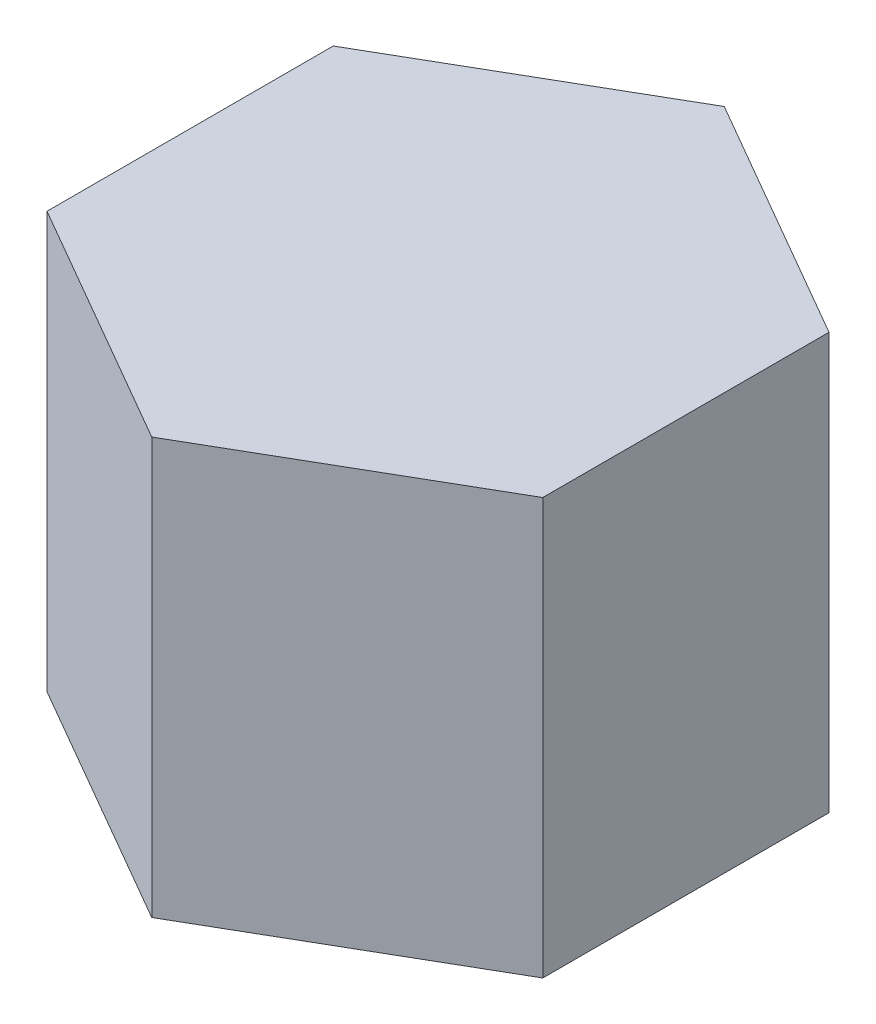
ISO-10303-21;
HEADER;
FILE_DESCRIPTION(('STEP AP214'),'2;1');
FILE_NAME('part.step','',(''),(''),'','','');
FILE_SCHEMA(('AUTOMOTIVE_DESIGN { 1 0 10303 214 1 1 1 1 }'));
ENDSEC;
DATA;
#1=APPLICATION_CONTEXT('core data for automotive mechanical design processes');
#2=APPLICATION_PROTOCOL_DEFINITION('international standard','automotive_design',2000,#1);
#3=PRODUCT_CONTEXT('',#1,'mechanical');
#4=PRODUCT('Part','Part','',(#3));
#5=PRODUCT_RELATED_PRODUCT_CATEGORY('part','',(#4));
#6=PRODUCT_DEFINITION_FORMATION('','',#4);
#7=PRODUCT_DEFINITION_CONTEXT('part definition',#1,'design');
#8=PRODUCT_DEFINITION('design','',#6,#7);
#9=PRODUCT_DEFINITION_SHAPE('','',#8);
#10=(LENGTH_UNIT() NAMED_UNIT(*) SI_UNIT(.MILLI.,.METRE.));
#11=(NAMED_UNIT(*) PLANE_ANGLE_UNIT() SI_UNIT($,.RADIAN.));
#12=(NAMED_UNIT(*) SI_UNIT($,.STERADIAN.) SOLID_ANGLE_UNIT());
#13=UNCERTAINTY_MEASURE_WITH_UNIT(LENGTH_MEASURE(1.E-05),#10,'distance_accuracy_value','');
#14=(GEOMETRIC_REPRESENTATION_CONTEXT(3) GLOBAL_UNCERTAINTY_ASSIGNED_CONTEXT((#13)) GLOBAL_UNIT_ASSIGNED_CONTEXT((#10,
#11,#12)) REPRESENTATION_CONTEXT('',''));
#15=CARTESIAN_POINT('',(0.,0.,0.));
#16=DIRECTION('',(0.,0.,1.));
#17=DIRECTION('',(1.,0.,0.));
#18=AXIS2_PLACEMENT_3D('',#15,#16,#17);
#19=CARTESIAN_POINT('',(209.839551417381,-147.556598747966,294.280047431848));
#20=DIRECTION('',(-0.500000000000062,0.,-0.866025403784403));
#21=DIRECTION('',(-0.866025403784403,0.,0.500000000000062));
#22=AXIS2_PLACEMENT_3D('',#19,#20,#21);
#23=PLANE('',#22);
#24=CARTESIAN_POINT('',(210.142660308706,-147.047793579175,294.105047431848));
#25=DIRECTION('',(-0.866025403784403,0.,0.500000000000062));
#26=VECTOR('',#25,1.);
#27=LINE('',#24,#26);
#28=CARTESIAN_POINT('',(210.142660308706,-147.047793579175,294.105047431848));
#29=VERTEX_POINT('',#28);
#30=CARTESIAN_POINT('',(209.839551417382,-147.047793579175,294.280047431848));
#31=VERTEX_POINT('',#30);
#32=EDGE_CURVE('E170',#29,#31,#27,.T.);
#33=ORIENTED_EDGE('',*,*,#32,.T.);
#34=CARTESIAN_POINT('',(209.839551417382,-147.556598747966,294.280047431848));
#35=DIRECTION('',(0.,1.,0.));
#36=VECTOR('',#35,1.);
#37=LINE('',#34,#36);
#38=CARTESIAN_POINT('',(209.839551417382,-147.556598747966,294.280047431848));
#39=VERTEX_POINT('',#38);
#40=EDGE_CURVE('E35',#39,#31,#37,.T.);
#41=ORIENTED_EDGE('',*,*,#40,.F.);
#42=CARTESIAN_POINT('',(210.142660308706,-147.556598747966,294.105047431848));
#43=DIRECTION('',(-0.866025403784403,0.,0.500000000000062));
#44=VECTOR('',#43,1.);
#45=LINE('',#42,#44);
#46=CARTESIAN_POINT('',(210.142660308706,-147.556598747966,294.105047431848));
#47=VERTEX_POINT('',#46);
#48=EDGE_CURVE('E159',#47,#39,#45,.T.);
#49=ORIENTED_EDGE('',*,*,#48,.F.);
#50=CARTESIAN_POINT('',(210.142660308706,-147.556598747966,294.105047431848));
#51=DIRECTION('',(0.,1.,0.));
#52=VECTOR('',#51,1.);
#53=LINE('',#50,#52);
#54=EDGE_CURVE('E10',#47,#29,#53,.T.);
#55=ORIENTED_EDGE('',*,*,#54,.T.);
#56=EDGE_LOOP('',(#33,#41,#49,#55));
#57=FACE_BOUND('',#56,.T.);
#58=ADVANCED_FACE('F16',(#57),#23,.F.);
#59=CARTESIAN_POINT('',(210.142660308706,-147.556598747966,291.594471220494));
#60=DIRECTION('',(-1.,0.,0.));
#61=DIRECTION('',(0.,-1.,0.));
#62=AXIS2_PLACEMENT_3D('',#59,#60,#61);
#63=PLANE('',#62);
#64=CARTESIAN_POINT('',(210.142660308706,-147.047793579175,293.755047431848));
#65=DIRECTION('',(0.,0.,1.));
#66=VECTOR('',#65,1.);
#67=LINE('',#64,#66);
#68=CARTESIAN_POINT('',(210.142660308706,-147.047793579175,293.755047431848));
#69=VERTEX_POINT('',#68);
#70=EDGE_CURVE('E167',#69,#29,#67,.T.);
#71=ORIENTED_EDGE('',*,*,#70,.T.);
#72=ORIENTED_EDGE('',*,*,#54,.F.);
#73=CARTESIAN_POINT('',(210.142660308706,-147.556598747966,293.755047431848));
#74=DIRECTION('',(0.,0.,1.));
#75=VECTOR('',#74,1.);
#76=LINE('',#73,#75);
#77=CARTESIAN_POINT('',(210.142660308706,-147.556598747966,293.755047431848));
#78=VERTEX_POINT('',#77);
#79=EDGE_CURVE('E156',#78,#47,#76,.T.);
#80=ORIENTED_EDGE('',*,*,#79,.F.);
#81=CARTESIAN_POINT('',(210.142660308706,-147.556598747966,293.755047431848));
#82=DIRECTION('',(0.,1.,0.));
#83=VECTOR('',#82,1.);
#84=LINE('',#81,#83);
#85=EDGE_CURVE('E27',#78,#69,#84,.T.);
#86=ORIENTED_EDGE('',*,*,#85,.T.);
#87=EDGE_LOOP('',(#71,#72,#80,#86));
#88=FACE_BOUND('',#87,.T.);
#89=ADVANCED_FACE('F189',(#88),#63,.F.);
#90=CARTESIAN_POINT('',(210.142660308706,-147.556598747966,293.755047431848));
#91=DIRECTION('',(-0.500000000000096,0.,0.866025403784383));
#92=DIRECTION('',(0.866025403784383,0.,0.500000000000096));
#93=AXIS2_PLACEMENT_3D('',#90,#91,#92);
#94=PLANE('',#93);
#95=CARTESIAN_POINT('',(209.839551417382,-147.047793579175,293.580047431848));
#96=DIRECTION('',(0.866025403784383,0.,0.500000000000096));
#97=VECTOR('',#96,1.);
#98=LINE('',#95,#97);
#99=CARTESIAN_POINT('',(209.839551417382,-147.047793579175,293.580047431848));
#100=VERTEX_POINT('',#99);
#101=EDGE_CURVE('E163',#100,#69,#98,.T.);
#102=ORIENTED_EDGE('',*,*,#101,.T.);
#103=ORIENTED_EDGE('',*,*,#85,.F.);
#104=CARTESIAN_POINT('',(209.839551417382,-147.556598747966,293.580047431848));
#105=DIRECTION('',(0.866025403784383,0.,0.500000000000096));
#106=VECTOR('',#105,1.);
#107=LINE('',#104,#106);
#108=CARTESIAN_POINT('',(209.839551417382,-147.556598747966,293.580047431848));
#109=VERTEX_POINT('',#108);
#110=EDGE_CURVE('E106',#109,#78,#107,.T.);
#111=ORIENTED_EDGE('',*,*,#110,.F.);
#112=CARTESIAN_POINT('',(209.839551417382,-147.556598747966,293.580047431848));
#113=DIRECTION('',(0.,1.,0.));
#114=VECTOR('',#113,1.);
#115=LINE('',#112,#114);
#116=EDGE_CURVE('E94',#109,#100,#115,.T.);
#117=ORIENTED_EDGE('',*,*,#116,.T.);
#118=EDGE_LOOP('',(#102,#103,#111,#117));
#119=FACE_BOUND('',#118,.T.);
#120=ADVANCED_FACE('F198',(#119),#94,.F.);
#121=CARTESIAN_POINT('',(209.839551417382,-147.556598747966,293.580047431848));
#122=DIRECTION('',(0.499999999999978,0.,0.866025403784452));
#123=DIRECTION('',(0.866025403784452,0.,-0.499999999999978));
#124=AXIS2_PLACEMENT_3D('',#121,#122,#123);
#125=PLANE('',#124);
#126=CARTESIAN_POINT('',(209.536442526057,-147.047793579175,293.755047431848));
#127=DIRECTION('',(0.866025403784452,0.,-0.499999999999978));
#128=VECTOR('',#127,1.);
#129=LINE('',#126,#128);
#130=CARTESIAN_POINT('',(209.536442526057,-147.047793579175,293.755047431848));
#131=VERTEX_POINT('',#130);
#132=EDGE_CURVE('E162',#131,#100,#129,.T.);
#133=ORIENTED_EDGE('',*,*,#132,.T.);
#134=ORIENTED_EDGE('',*,*,#116,.F.);
#135=CARTESIAN_POINT('',(209.536442526057,-147.556598747966,293.755047431848));
#136=DIRECTION('',(0.866025403784452,0.,-0.499999999999978));
#137=VECTOR('',#136,1.);
#138=LINE('',#135,#137);
#139=CARTESIAN_POINT('',(209.536442526057,-147.556598747966,293.755047431848));
#140=VERTEX_POINT('',#139);
#141=EDGE_CURVE('E98',#140,#109,#138,.T.);
#142=ORIENTED_EDGE('',*,*,#141,.F.);
#143=CARTESIAN_POINT('',(209.536442526057,-147.556598747966,293.755047431848));
#144=DIRECTION('',(0.,1.,0.));
#145=VECTOR('',#144,1.);
#146=LINE('',#143,#145);
#147=EDGE_CURVE('E79',#140,#131,#146,.T.);
#148=ORIENTED_EDGE('',*,*,#147,.T.);
#149=EDGE_LOOP('',(#133,#134,#142,#148));
#150=FACE_BOUND('',#149,.T.);
#151=ADVANCED_FACE('F100',(#150),#125,.F.);
#152=CARTESIAN_POINT('',(209.536442526057,-147.556598747966,291.594471220494));
#153=DIRECTION('',(1.,0.,0.));
#154=DIRECTION('',(0.,1.,0.));
#155=AXIS2_PLACEMENT_3D('',#152,#153,#154);
#156=PLANE('',#155);
#157=CARTESIAN_POINT('',(209.536442526057,-147.047793579175,294.105047431848));
#158=DIRECTION('',(0.,0.,-1.));
#159=VECTOR('',#158,1.);
#160=LINE('',#157,#159);
#161=CARTESIAN_POINT('',(209.536442526057,-147.047793579175,294.105047431848));
#162=VERTEX_POINT('',#161);
#163=EDGE_CURVE('E88',#162,#131,#160,.T.);
#164=ORIENTED_EDGE('',*,*,#163,.T.);
#165=ORIENTED_EDGE('',*,*,#147,.F.);
#166=CARTESIAN_POINT('',(209.536442526057,-147.556598747966,294.105047431848));
#167=DIRECTION('',(0.,0.,-1.));
#168=VECTOR('',#167,1.);
#169=LINE('',#166,#168);
#170=CARTESIAN_POINT('',(209.536442526057,-147.556598747966,294.105047431848));
#171=VERTEX_POINT('',#170);
#172=EDGE_CURVE('E84',#171,#140,#169,.T.);
#173=ORIENTED_EDGE('',*,*,#172,.F.);
#174=CARTESIAN_POINT('',(209.536442526057,-147.556598747966,294.105047431848));
#175=DIRECTION('',(0.,1.,0.));
#176=VECTOR('',#175,1.);
#177=LINE('',#174,#176);
#178=EDGE_CURVE('E58',#171,#162,#177,.T.);
#179=ORIENTED_EDGE('',*,*,#178,.T.);
#180=EDGE_LOOP('',(#164,#165,#173,#179));
#181=FACE_BOUND('',#180,.T.);
#182=ADVANCED_FACE('F82',(#181),#156,.F.);
#183=CARTESIAN_POINT('',(209.536442526057,-147.556598747966,294.105047431848));
#184=DIRECTION('',(0.500000000000096,0.,-0.866025403784383));
#185=DIRECTION('',(-0.866025403784383,0.,-0.500000000000096));
#186=AXIS2_PLACEMENT_3D('',#183,#184,#185);
#187=PLANE('',#186);
#188=CARTESIAN_POINT('',(209.839551417382,-147.047793579175,294.280047431848));
#189=DIRECTION('',(-0.866025403784383,0.,-0.500000000000096));
#190=VECTOR('',#189,1.);
#191=LINE('',#188,#190);
#192=EDGE_CURVE('E160',#31,#162,#191,.T.);
#193=ORIENTED_EDGE('',*,*,#192,.T.);
#194=ORIENTED_EDGE('',*,*,#178,.F.);
#195=CARTESIAN_POINT('',(209.839551417382,-147.556598747966,294.280047431848));
#196=DIRECTION('',(-0.866025403784383,0.,-0.500000000000096));
#197=VECTOR('',#196,1.);
#198=LINE('',#195,#197);
#199=EDGE_CURVE('E112',#39,#171,#198,.T.);
#200=ORIENTED_EDGE('',*,*,#199,.F.);
#201=ORIENTED_EDGE('',*,*,#40,.T.);
#202=EDGE_LOOP('',(#193,#194,#200,#201));
#203=FACE_BOUND('',#202,.T.);
#204=ADVANCED_FACE('F131',(#203),#187,.F.);
#205=CARTESIAN_POINT('',(206.491105863044,-147.556598747966,291.594471220494));
#206=DIRECTION('',(0.,1.,0.));
#207=DIRECTION('',(-1.,0.,0.));
#208=AXIS2_PLACEMENT_3D('',#205,#206,#207);
#209=PLANE('',#208);
#210=ORIENTED_EDGE('',*,*,#48,.T.);
#211=ORIENTED_EDGE('',*,*,#199,.T.);
#212=ORIENTED_EDGE('',*,*,#172,.T.);
#213=ORIENTED_EDGE('',*,*,#141,.T.);
#214=ORIENTED_EDGE('',*,*,#110,.T.);
#215=ORIENTED_EDGE('',*,*,#79,.T.);
#216=EDGE_LOOP('',(#210,#211,#212,#213,#214,#215));
#217=FACE_BOUND('',#216,.T.);
#218=ADVANCED_FACE('F111',(#217),#209,.F.);
#219=CARTESIAN_POINT('',(206.491105863044,-147.047793579175,291.594471220494));
#220=DIRECTION('',(0.,1.,0.));
#221=DIRECTION('',(-1.,0.,0.));
#222=AXIS2_PLACEMENT_3D('',#219,#220,#221);
#223=PLANE('',#222);
#224=ORIENTED_EDGE('',*,*,#32,.F.);
#225=ORIENTED_EDGE('',*,*,#70,.F.);
#226=ORIENTED_EDGE('',*,*,#101,.F.);
#227=ORIENTED_EDGE('',*,*,#132,.F.);
#228=ORIENTED_EDGE('',*,*,#163,.F.);
#229=ORIENTED_EDGE('',*,*,#192,.F.);
#230=EDGE_LOOP('',(#224,#225,#226,#227,#228,#229));
#231=FACE_BOUND('',#230,.T.);
#232=ADVANCED_FACE('F130',(#231),#223,.T.);
#233=CLOSED_SHELL('',(#58,#89,#120,#151,#182,#204,#218,#232));
#234=MANIFOLD_SOLID_BREP('B1',#233);
#235=ADVANCED_BREP_SHAPE_REPRESENTATION('',(#18,#234),#14);
#236=SHAPE_DEFINITION_REPRESENTATION(#9,#235);
ENDSEC;
END-ISO-10303-21;
